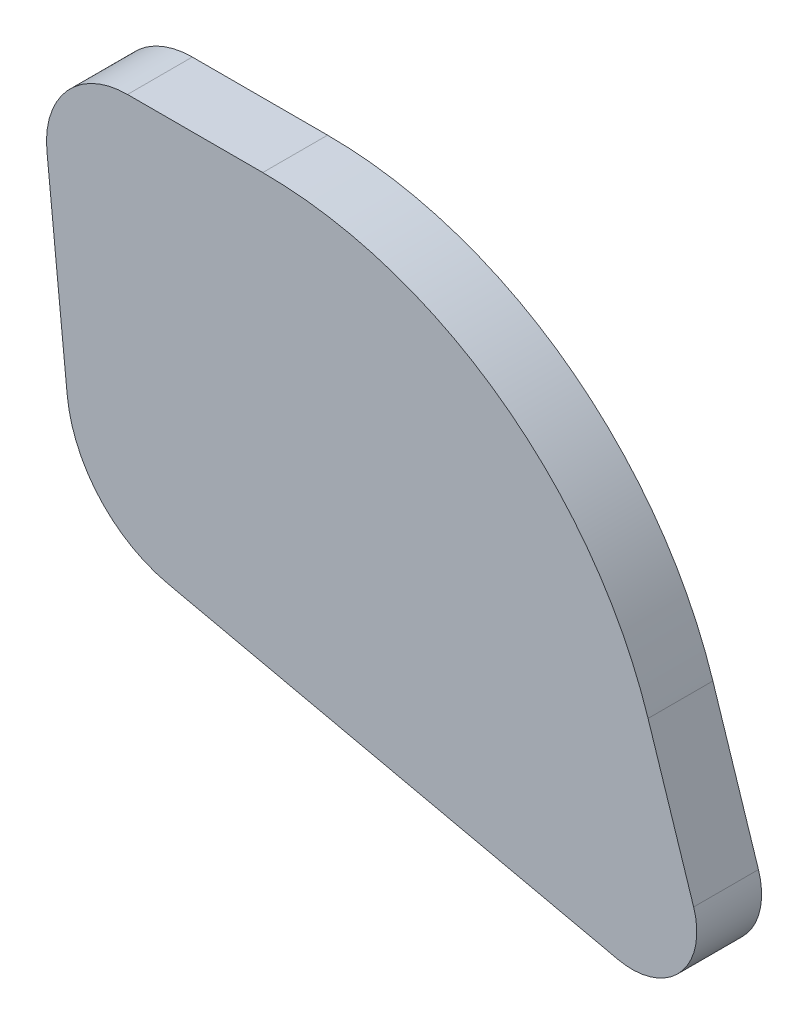
ISO-10303-21;
HEADER;
FILE_DESCRIPTION(('STEP AP214'),'2;1');
FILE_NAME('part.step','',(''),(''),'','','');
FILE_SCHEMA(('AUTOMOTIVE_DESIGN { 1 0 10303 214 1 1 1 1 }'));
ENDSEC;
DATA;
#1=APPLICATION_CONTEXT('core data for automotive mechanical design processes');
#2=APPLICATION_PROTOCOL_DEFINITION('international standard','automotive_design',2000,#1);
#3=PRODUCT_CONTEXT('',#1,'mechanical');
#4=PRODUCT('Part','Part','',(#3));
#5=PRODUCT_RELATED_PRODUCT_CATEGORY('part','',(#4));
#6=PRODUCT_DEFINITION_FORMATION('','',#4);
#7=PRODUCT_DEFINITION_CONTEXT('part definition',#1,'design');
#8=PRODUCT_DEFINITION('design','',#6,#7);
#9=PRODUCT_DEFINITION_SHAPE('','',#8);
#10=(LENGTH_UNIT() NAMED_UNIT(*) SI_UNIT(.MILLI.,.METRE.));
#11=(NAMED_UNIT(*) PLANE_ANGLE_UNIT() SI_UNIT($,.RADIAN.));
#12=(NAMED_UNIT(*) SI_UNIT($,.STERADIAN.) SOLID_ANGLE_UNIT());
#13=UNCERTAINTY_MEASURE_WITH_UNIT(LENGTH_MEASURE(1.E-05),#10,'distance_accuracy_value','');
#14=(GEOMETRIC_REPRESENTATION_CONTEXT(3) GLOBAL_UNCERTAINTY_ASSIGNED_CONTEXT((#13)) GLOBAL_UNIT_ASSIGNED_CONTEXT((#10,
#11,#12)) REPRESENTATION_CONTEXT('',''));
#15=CARTESIAN_POINT('',(0.,0.,0.));
#16=DIRECTION('',(0.,0.,1.));
#17=DIRECTION('',(1.,0.,0.));
#18=AXIS2_PLACEMENT_3D('',#15,#16,#17);
#19=CARTESIAN_POINT('',(150.540132186907,199.85594208637,3.57124141935484));
#20=DIRECTION('',(0.,0.,-1.));
#21=DIRECTION('',(-1.,0.,0.));
#22=AXIS2_PLACEMENT_3D('',#19,#20,#21);
#23=CYLINDRICAL_SURFACE('',#22,3.92810354838709);
#24=CARTESIAN_POINT('',(150.540132186907,199.85594208637,0.428758580645161));
#25=DIRECTION('',(0.,0.,1.));
#26=DIRECTION('',(1.,0.,0.));
#27=AXIS2_PLACEMENT_3D('',#24,#25,#26);
#28=CIRCLE('',#27,3.92810354838709);
#29=CARTESIAN_POINT('',(150.540132186907,203.784045634757,0.428758580645161));
#30=VERTEX_POINT('',#29);
#31=CARTESIAN_POINT('',(146.631858501272,199.461741268227,0.428758580645161));
#32=VERTEX_POINT('',#31);
#33=EDGE_CURVE('E133',#30,#32,#28,.T.);
#34=ORIENTED_EDGE('',*,*,#33,.T.);
#35=DIRECTION('',(0.,0.,-1.));
#36=VECTOR('',#35,1.);
#37=CARTESIAN_POINT('',(146.631858501272,199.461741268227,3.57124141935484));
#38=LINE('',#37,#36);
#39=CARTESIAN_POINT('',(146.631858501272,199.461741268227,3.57124141935484));
#40=VERTEX_POINT('',#39);
#41=EDGE_CURVE('E11',#40,#32,#38,.T.);
#42=ORIENTED_EDGE('',*,*,#41,.F.);
#43=CARTESIAN_POINT('',(150.540132186907,199.85594208637,3.57124141935484));
#44=DIRECTION('',(0.,0.,1.));
#45=DIRECTION('',(1.,0.,0.));
#46=AXIS2_PLACEMENT_3D('',#43,#44,#45);
#47=CIRCLE('',#46,3.92810354838709);
#48=CARTESIAN_POINT('',(150.540132186907,203.784045634757,3.57124141935484));
#49=VERTEX_POINT('',#48);
#50=EDGE_CURVE('E147',#49,#40,#47,.T.);
#51=ORIENTED_EDGE('',*,*,#50,.F.);
#52=DIRECTION('',(0.,0.,-1.));
#53=VECTOR('',#52,1.);
#54=CARTESIAN_POINT('',(150.540132186907,203.784045634757,3.57124141935484));
#55=LINE('',#54,#53);
#56=EDGE_CURVE('E129',#49,#30,#55,.T.);
#57=ORIENTED_EDGE('',*,*,#56,.T.);
#58=EDGE_LOOP('',(#34,#42,#51,#57));
#59=FACE_BOUND('',#58,.T.);
#60=ADVANCED_FACE('F37',(#59),#23,.T.);
#61=CARTESIAN_POINT('',(147.61427513436,189.721647136713,3.57124141935484));
#62=DIRECTION('',(0.994951797347548,0.100353978271337,0.));
#63=DIRECTION('',(-0.100353978271337,0.994951797347548,0.));
#64=AXIS2_PLACEMENT_3D('',#61,#62,#63);
#65=PLANE('',#64);
#66=DIRECTION('',(0.100353978271337,-0.994951797347548,0.));
#67=VECTOR('',#66,1.);
#68=CARTESIAN_POINT('',(147.61427513436,189.721647136713,0.428758580645161));
#69=LINE('',#68,#67);
#70=CARTESIAN_POINT('',(147.61427513436,189.721647136713,0.428758580645161));
#71=VERTEX_POINT('',#70);
#72=EDGE_CURVE('E136',#32,#71,#69,.T.);
#73=ORIENTED_EDGE('',*,*,#72,.T.);
#74=DIRECTION('',(0.,0.,-1.));
#75=VECTOR('',#74,1.);
#76=CARTESIAN_POINT('',(147.61427513436,189.721647136713,3.57124141935484));
#77=LINE('',#76,#75);
#78=CARTESIAN_POINT('',(147.61427513436,189.721647136713,3.57124141935484));
#79=VERTEX_POINT('',#78);
#80=EDGE_CURVE('E45',#79,#71,#77,.T.);
#81=ORIENTED_EDGE('',*,*,#80,.F.);
#82=DIRECTION('',(0.100353978271337,-0.994951797347548,0.));
#83=VECTOR('',#82,1.);
#84=CARTESIAN_POINT('',(147.61427513436,189.721647136713,3.57124141935484));
#85=LINE('',#84,#83);
#86=EDGE_CURVE('E96',#40,#79,#85,.T.);
#87=ORIENTED_EDGE('',*,*,#86,.F.);
#88=ORIENTED_EDGE('',*,*,#41,.T.);
#89=EDGE_LOOP('',(#73,#81,#87,#88));
#90=FACE_BOUND('',#89,.T.);
#91=ADVANCED_FACE('F182',(#90),#65,.F.);
#92=CARTESIAN_POINT('',(153.867513031376,190.352368445741,3.57124141935484));
#93=DIRECTION('',(0.,0.,-1.));
#94=DIRECTION('',(-1.,0.,0.));
#95=AXIS2_PLACEMENT_3D('',#92,#93,#94);
#96=CYLINDRICAL_SURFACE('',#95,6.28496567741935);
#97=CARTESIAN_POINT('',(153.867513031376,190.352368445741,0.428758580645161));
#98=DIRECTION('',(0.,0.,1.));
#99=DIRECTION('',(-1.,0.,0.));
#100=AXIS2_PLACEMENT_3D('',#97,#98,#99);
#101=CIRCLE('',#100,6.28496567741935);
#102=CARTESIAN_POINT('',(152.499439716644,184.218106552745,0.428758580645161));
#103=VERTEX_POINT('',#102);
#104=EDGE_CURVE('E138',#71,#103,#101,.T.);
#105=ORIENTED_EDGE('',*,*,#104,.T.);
#106=DIRECTION('',(0.,0.,-1.));
#107=VECTOR('',#106,1.);
#108=CARTESIAN_POINT('',(152.499439716644,184.218106552745,3.57124141935484));
#109=LINE('',#108,#107);
#110=CARTESIAN_POINT('',(152.499439716644,184.218106552745,3.57124141935484));
#111=VERTEX_POINT('',#110);
#112=EDGE_CURVE('E154',#111,#103,#109,.T.);
#113=ORIENTED_EDGE('',*,*,#112,.F.);
#114=CARTESIAN_POINT('',(153.867513031376,190.352368445741,3.57124141935484));
#115=DIRECTION('',(0.,0.,1.));
#116=DIRECTION('',(-1.,0.,0.));
#117=AXIS2_PLACEMENT_3D('',#114,#115,#116);
#118=CIRCLE('',#117,6.28496567741935);
#119=EDGE_CURVE('E162',#79,#111,#118,.T.);
#120=ORIENTED_EDGE('',*,*,#119,.F.);
#121=ORIENTED_EDGE('',*,*,#80,.T.);
#122=EDGE_LOOP('',(#105,#113,#120,#121));
#123=FACE_BOUND('',#122,.T.);
#124=ADVANCED_FACE('F160',(#123),#96,.T.);
#125=CARTESIAN_POINT('',(174.318935492825,179.35188622616,3.57124141935484));
#126=DIRECTION('',(0.217673951609138,0.976021542175613,0.));
#127=DIRECTION('',(-0.976021542175613,0.217673951609138,0.));
#128=AXIS2_PLACEMENT_3D('',#125,#126,#127);
#129=PLANE('',#128);
#130=DIRECTION('',(0.976021542175613,-0.217673951609138,0.));
#131=VECTOR('',#130,1.);
#132=CARTESIAN_POINT('',(174.318935492825,179.35188622616,0.428758580645161));
#133=LINE('',#132,#131);
#134=CARTESIAN_POINT('',(174.318935492825,179.35188622616,0.428758580645161));
#135=VERTEX_POINT('',#134);
#136=EDGE_CURVE('E140',#103,#135,#133,.T.);
#137=ORIENTED_EDGE('',*,*,#136,.T.);
#138=DIRECTION('',(0.,0.,-1.));
#139=VECTOR('',#138,1.);
#140=CARTESIAN_POINT('',(174.318935492825,179.35188622616,3.57124141935484));
#141=LINE('',#140,#139);
#142=CARTESIAN_POINT('',(174.318935492825,179.35188622616,3.57124141935484));
#143=VERTEX_POINT('',#142);
#144=EDGE_CURVE('E151',#143,#135,#141,.T.);
#145=ORIENTED_EDGE('',*,*,#144,.F.);
#146=DIRECTION('',(0.976021542175613,-0.217673951609138,0.));
#147=VECTOR('',#146,1.);
#148=CARTESIAN_POINT('',(174.318935492825,179.35188622616,3.57124141935484));
#149=LINE('',#148,#147);
#150=EDGE_CURVE('E174',#111,#143,#149,.T.);
#151=ORIENTED_EDGE('',*,*,#150,.F.);
#152=ORIENTED_EDGE('',*,*,#112,.T.);
#153=EDGE_LOOP('',(#137,#145,#151,#152));
#154=FACE_BOUND('',#153,.T.);
#155=ADVANCED_FACE('F170',(#154),#129,.F.);
#156=CARTESIAN_POINT('',(175.002972150191,182.419017172658,3.57124141935484));
#157=DIRECTION('',(0.,0.,-1.));
#158=DIRECTION('',(-1.,0.,0.));
#159=AXIS2_PLACEMENT_3D('',#156,#157,#158);
#160=CYLINDRICAL_SURFACE('',#159,3.1424828387097);
#161=CARTESIAN_POINT('',(175.002972150191,182.419017172658,0.428758580645161));
#162=DIRECTION('',(0.,0.,1.));
#163=DIRECTION('',(-1.,0.,0.));
#164=AXIS2_PLACEMENT_3D('',#161,#162,#163);
#165=CIRCLE('',#164,3.1424828387097);
#166=CARTESIAN_POINT('',(177.992173534527,183.388487891902,0.428758580645161));
#167=VERTEX_POINT('',#166);
#168=EDGE_CURVE('E142',#135,#167,#165,.T.);
#169=ORIENTED_EDGE('',*,*,#168,.T.);
#170=DIRECTION('',(0.,0.,-1.));
#171=VECTOR('',#170,1.);
#172=CARTESIAN_POINT('',(177.992173534527,183.388487891902,3.57124141935484));
#173=LINE('',#172,#171);
#174=CARTESIAN_POINT('',(177.992173534527,183.388487891902,3.57124141935484));
#175=VERTEX_POINT('',#174);
#176=EDGE_CURVE('E124',#175,#167,#173,.T.);
#177=ORIENTED_EDGE('',*,*,#176,.F.);
#178=CARTESIAN_POINT('',(175.002972150191,182.419017172658,3.57124141935484));
#179=DIRECTION('',(0.,0.,1.));
#180=DIRECTION('',(-1.,0.,0.));
#181=AXIS2_PLACEMENT_3D('',#178,#179,#180);
#182=CIRCLE('',#181,3.1424828387097);
#183=EDGE_CURVE('E115',#143,#175,#182,.T.);
#184=ORIENTED_EDGE('',*,*,#183,.F.);
#185=ORIENTED_EDGE('',*,*,#144,.T.);
#186=EDGE_LOOP('',(#169,#177,#184,#185));
#187=FACE_BOUND('',#186,.T.);
#188=ADVANCED_FACE('F173',(#187),#160,.T.);
#189=CARTESIAN_POINT('',(175.782152346572,190.202719888096,3.57124141935484));
#190=DIRECTION('',(-0.951222818948762,-0.308504698037438,0.));
#191=DIRECTION('',(0.308504698037438,-0.951222818948762,0.));
#192=AXIS2_PLACEMENT_3D('',#189,#190,#191);
#193=PLANE('',#192);
#194=DIRECTION('',(-0.308504698037438,0.951222818948762,0.));
#195=VECTOR('',#194,1.);
#196=CARTESIAN_POINT('',(175.782152346572,190.202719888096,0.428758580645161));
#197=LINE('',#196,#195);
#198=CARTESIAN_POINT('',(175.782152346572,190.202719888096,0.428758580645161));
#199=VERTEX_POINT('',#198);
#200=EDGE_CURVE('E123',#167,#199,#197,.T.);
#201=ORIENTED_EDGE('',*,*,#200,.T.);
#202=DIRECTION('',(0.,0.,-1.));
#203=VECTOR('',#202,1.);
#204=CARTESIAN_POINT('',(175.782152346572,190.202719888096,3.57124141935484));
#205=LINE('',#204,#203);
#206=CARTESIAN_POINT('',(175.782152346572,190.202719888096,3.57124141935484));
#207=VERTEX_POINT('',#206);
#208=EDGE_CURVE('E120',#207,#199,#205,.T.);
#209=ORIENTED_EDGE('',*,*,#208,.F.);
#210=DIRECTION('',(-0.308504698037438,0.951222818948762,0.));
#211=VECTOR('',#210,1.);
#212=CARTESIAN_POINT('',(175.782152346572,190.202719888096,3.57124141935484));
#213=LINE('',#212,#211);
#214=EDGE_CURVE('E109',#175,#207,#213,.T.);
#215=ORIENTED_EDGE('',*,*,#214,.F.);
#216=ORIENTED_EDGE('',*,*,#176,.T.);
#217=EDGE_LOOP('',(#201,#209,#215,#216));
#218=FACE_BOUND('',#217,.T.);
#219=ADVANCED_FACE('F121',(#218),#193,.F.);
#220=CARTESIAN_POINT('',(157.099643694475,184.143527892821,3.57124141935484));
#221=DIRECTION('',(0.,0.,-1.));
#222=DIRECTION('',(-1.,0.,0.));
#223=AXIS2_PLACEMENT_3D('',#220,#221,#222);
#224=CYLINDRICAL_SURFACE('',#223,19.6405177419355);
#225=CARTESIAN_POINT('',(157.099643694475,184.143527892821,0.428758580645161));
#226=DIRECTION('',(0.,0.,1.));
#227=DIRECTION('',(-1.,0.,0.));
#228=AXIS2_PLACEMENT_3D('',#225,#226,#227);
#229=CIRCLE('',#228,19.6405177419355);
#230=CARTESIAN_POINT('',(157.099643694475,203.784045634757,0.428758580645161));
#231=VERTEX_POINT('',#230);
#232=EDGE_CURVE('E82',#199,#231,#229,.T.);
#233=ORIENTED_EDGE('',*,*,#232,.T.);
#234=DIRECTION('',(0.,0.,-1.));
#235=VECTOR('',#234,1.);
#236=CARTESIAN_POINT('',(157.099643694475,203.784045634757,3.57124141935484));
#237=LINE('',#236,#235);
#238=CARTESIAN_POINT('',(157.099643694475,203.784045634757,3.57124141935484));
#239=VERTEX_POINT('',#238);
#240=EDGE_CURVE('E125',#239,#231,#237,.T.);
#241=ORIENTED_EDGE('',*,*,#240,.F.);
#242=CARTESIAN_POINT('',(157.099643694475,184.143527892821,3.57124141935484));
#243=DIRECTION('',(0.,0.,1.));
#244=DIRECTION('',(-1.,0.,0.));
#245=AXIS2_PLACEMENT_3D('',#242,#243,#244);
#246=CIRCLE('',#245,19.6405177419355);
#247=EDGE_CURVE('E113',#207,#239,#246,.T.);
#248=ORIENTED_EDGE('',*,*,#247,.F.);
#249=ORIENTED_EDGE('',*,*,#208,.T.);
#250=EDGE_LOOP('',(#233,#241,#248,#249));
#251=FACE_BOUND('',#250,.T.);
#252=ADVANCED_FACE('F127',(#251),#224,.T.);
#253=CARTESIAN_POINT('',(150.540132186907,203.784045634757,3.57124141935484));
#254=DIRECTION('',(0.,-1.,0.));
#255=DIRECTION('',(0.,0.,-1.));
#256=AXIS2_PLACEMENT_3D('',#253,#254,#255);
#257=PLANE('',#256);
#258=DIRECTION('',(-1.,0.,0.));
#259=VECTOR('',#258,1.);
#260=CARTESIAN_POINT('',(150.540132186907,203.784045634757,0.428758580645161));
#261=LINE('',#260,#259);
#262=EDGE_CURVE('E88',#231,#30,#261,.T.);
#263=ORIENTED_EDGE('',*,*,#262,.T.);
#264=ORIENTED_EDGE('',*,*,#56,.F.);
#265=DIRECTION('',(-1.,0.,0.));
#266=VECTOR('',#265,1.);
#267=CARTESIAN_POINT('',(150.540132186907,203.784045634757,3.57124141935484));
#268=LINE('',#267,#266);
#269=EDGE_CURVE('E53',#239,#49,#268,.T.);
#270=ORIENTED_EDGE('',*,*,#269,.F.);
#271=ORIENTED_EDGE('',*,*,#240,.T.);
#272=EDGE_LOOP('',(#263,#264,#270,#271));
#273=FACE_BOUND('',#272,.T.);
#274=ADVANCED_FACE('F198',(#273),#257,.F.);
#275=CARTESIAN_POINT('',(150.540132186907,199.85594208637,3.57124141935484));
#276=DIRECTION('',(0.,0.,1.));
#277=DIRECTION('',(1.,0.,0.));
#278=AXIS2_PLACEMENT_3D('',#275,#276,#277);
#279=PLANE('',#278);
#280=ORIENTED_EDGE('',*,*,#50,.T.);
#281=ORIENTED_EDGE('',*,*,#86,.T.);
#282=ORIENTED_EDGE('',*,*,#119,.T.);
#283=ORIENTED_EDGE('',*,*,#150,.T.);
#284=ORIENTED_EDGE('',*,*,#183,.T.);
#285=ORIENTED_EDGE('',*,*,#214,.T.);
#286=ORIENTED_EDGE('',*,*,#247,.T.);
#287=ORIENTED_EDGE('',*,*,#269,.T.);
#288=EDGE_LOOP('',(#280,#281,#282,#283,#284,#285,#286,#287));
#289=FACE_BOUND('',#288,.T.);
#290=ADVANCED_FACE('F111',(#289),#279,.T.);
#291=CARTESIAN_POINT('',(150.540132186907,199.85594208637,0.428758580645161));
#292=DIRECTION('',(0.,0.,1.));
#293=DIRECTION('',(1.,0.,0.));
#294=AXIS2_PLACEMENT_3D('',#291,#292,#293);
#295=PLANE('',#294);
#296=ORIENTED_EDGE('',*,*,#33,.F.);
#297=ORIENTED_EDGE('',*,*,#262,.F.);
#298=ORIENTED_EDGE('',*,*,#232,.F.);
#299=ORIENTED_EDGE('',*,*,#200,.F.);
#300=ORIENTED_EDGE('',*,*,#168,.F.);
#301=ORIENTED_EDGE('',*,*,#136,.F.);
#302=ORIENTED_EDGE('',*,*,#104,.F.);
#303=ORIENTED_EDGE('',*,*,#72,.F.);
#304=EDGE_LOOP('',(#296,#297,#298,#299,#300,#301,#302,#303));
#305=FACE_BOUND('',#304,.T.);
#306=ADVANCED_FACE('F166',(#305),#295,.F.);
#307=CLOSED_SHELL('',(#60,#91,#124,#155,#188,#219,#252,#274,#290,#306));
#308=MANIFOLD_SOLID_BREP('B2',#307);
#309=ADVANCED_BREP_SHAPE_REPRESENTATION('',(#18,#308),#14);
#310=SHAPE_DEFINITION_REPRESENTATION(#9,#309);
ENDSEC;
END-ISO-10303-21;
